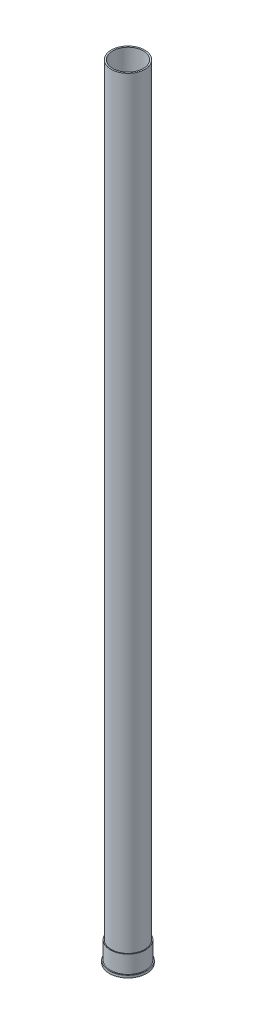
ISO-10303-21;
HEADER;
FILE_DESCRIPTION(('STEP AP214'),'2;1');
FILE_NAME('part.step','',(''),(''),'','','');
FILE_SCHEMA(('AUTOMOTIVE_DESIGN { 1 0 10303 214 1 1 1 1 }'));
ENDSEC;
DATA;
#1=APPLICATION_CONTEXT('core data for automotive mechanical design processes');
#2=APPLICATION_PROTOCOL_DEFINITION('international standard','automotive_design',2000,#1);
#3=PRODUCT_CONTEXT('',#1,'mechanical');
#4=PRODUCT('Part','Part','',(#3));
#5=PRODUCT_RELATED_PRODUCT_CATEGORY('part','',(#4));
#6=PRODUCT_DEFINITION_FORMATION('','',#4);
#7=PRODUCT_DEFINITION_CONTEXT('part definition',#1,'design');
#8=PRODUCT_DEFINITION('design','',#6,#7);
#9=PRODUCT_DEFINITION_SHAPE('','',#8);
#10=(LENGTH_UNIT() NAMED_UNIT(*) SI_UNIT(.MILLI.,.METRE.));
#11=(NAMED_UNIT(*) PLANE_ANGLE_UNIT() SI_UNIT($,.RADIAN.));
#12=(NAMED_UNIT(*) SI_UNIT($,.STERADIAN.) SOLID_ANGLE_UNIT());
#13=UNCERTAINTY_MEASURE_WITH_UNIT(LENGTH_MEASURE(1.E-05),#10,'distance_accuracy_value','');
#14=(GEOMETRIC_REPRESENTATION_CONTEXT(3) GLOBAL_UNCERTAINTY_ASSIGNED_CONTEXT((#13)) GLOBAL_UNIT_ASSIGNED_CONTEXT((#10,
#11,#12)) REPRESENTATION_CONTEXT('',''));
#15=CARTESIAN_POINT('',(0.,0.,0.));
#16=DIRECTION('',(0.,0.,1.));
#17=DIRECTION('',(1.,0.,0.));
#18=AXIS2_PLACEMENT_3D('',#15,#16,#17);
#19=CARTESIAN_POINT('',(0.,15.,0.));
#20=DIRECTION('',(0.,-1.,0.));
#21=DIRECTION('',(0.,0.,-1.));
#22=AXIS2_PLACEMENT_3D('',#19,#20,#21);
#23=CYLINDRICAL_SURFACE('',#22,13.462);
#24=CARTESIAN_POINT('',(0.,15.,0.));
#25=DIRECTION('',(0.,1.,0.));
#26=DIRECTION('',(0.,0.,1.));
#27=AXIS2_PLACEMENT_3D('',#24,#25,#26);
#28=CIRCLE('',#27,13.462);
#29=CARTESIAN_POINT('',(0.,15.,13.462));
#30=VERTEX_POINT('',#29);
#31=EDGE_CURVE('E51',#30,#30,#28,.T.);
#32=ORIENTED_EDGE('',*,*,#31,.T.);
#33=EDGE_LOOP('',(#32));
#34=FACE_BOUND('',#33,.T.);
#35=CARTESIAN_POINT('',(0.,-2.,0.));
#36=DIRECTION('',(0.,1.,0.));
#37=DIRECTION('',(0.,0.,1.));
#38=AXIS2_PLACEMENT_3D('',#35,#36,#37);
#39=CIRCLE('',#38,13.462);
#40=CARTESIAN_POINT('',(0.,-2.,13.462));
#41=VERTEX_POINT('',#40);
#42=EDGE_CURVE('E79',#41,#41,#39,.T.);
#43=ORIENTED_EDGE('',*,*,#42,.F.);
#44=EDGE_LOOP('',(#43));
#45=FACE_BOUND('',#44,.T.);
#46=ADVANCED_FACE('F43',(#34,#45),#23,.F.);
#47=CARTESIAN_POINT('',(0.,15.,0.));
#48=DIRECTION('',(0.,-1.,0.));
#49=DIRECTION('',(0.,0.,-1.));
#50=AXIS2_PLACEMENT_3D('',#47,#48,#49);
#51=CYLINDRICAL_SURFACE('',#50,15.);
#52=CARTESIAN_POINT('',(0.,15.,0.));
#53=DIRECTION('',(0.,1.,0.));
#54=DIRECTION('',(0.,0.,1.));
#55=AXIS2_PLACEMENT_3D('',#52,#53,#54);
#56=CIRCLE('',#55,15.);
#57=CARTESIAN_POINT('',(0.,15.,15.));
#58=VERTEX_POINT('',#57);
#59=EDGE_CURVE('E10',#58,#58,#56,.T.);
#60=ORIENTED_EDGE('',*,*,#59,.F.);
#61=EDGE_LOOP('',(#60));
#62=FACE_BOUND('',#61,.T.);
#63=CARTESIAN_POINT('',(0.,0.,0.));
#64=DIRECTION('',(0.,1.,0.));
#65=DIRECTION('',(0.,0.,1.));
#66=AXIS2_PLACEMENT_3D('',#63,#64,#65);
#67=CIRCLE('',#66,15.);
#68=CARTESIAN_POINT('',(0.,0.,15.));
#69=VERTEX_POINT('',#68);
#70=EDGE_CURVE('E46',#69,#69,#67,.T.);
#71=ORIENTED_EDGE('',*,*,#70,.T.);
#72=EDGE_LOOP('',(#71));
#73=FACE_BOUND('',#72,.T.);
#74=ADVANCED_FACE('F98',(#62,#73),#51,.T.);
#75=CARTESIAN_POINT('',(0.,15.,0.));
#76=DIRECTION('',(0.,1.,0.));
#77=DIRECTION('',(0.,0.,1.));
#78=AXIS2_PLACEMENT_3D('',#75,#76,#77);
#79=PLANE('',#78);
#80=CARTESIAN_POINT('',(0.,15.,0.));
#81=DIRECTION('',(0.,1.,0.));
#82=DIRECTION('',(0.,0.,1.));
#83=AXIS2_PLACEMENT_3D('',#80,#81,#82);
#84=CIRCLE('',#83,14.2875);
#85=CARTESIAN_POINT('',(0.,15.,14.2875));
#86=VERTEX_POINT('',#85);
#87=EDGE_CURVE('E59',#86,#86,#84,.T.);
#88=ORIENTED_EDGE('',*,*,#87,.F.);
#89=EDGE_LOOP('',(#88));
#90=FACE_BOUND('',#89,.T.);
#91=ORIENTED_EDGE('',*,*,#59,.T.);
#92=EDGE_LOOP('',(#91));
#93=FACE_BOUND('',#92,.T.);
#94=ADVANCED_FACE('F103',(#90,#93),#79,.T.);
#95=CARTESIAN_POINT('',(0.,15.,0.));
#96=DIRECTION('',(0.,1.,0.));
#97=DIRECTION('',(0.,0.,1.));
#98=AXIS2_PLACEMENT_3D('',#95,#96,#97);
#99=PLANE('',#98);
#100=CARTESIAN_POINT('',(0.,15.,0.));
#101=DIRECTION('',(0.,1.,0.));
#102=DIRECTION('',(0.,0.,1.));
#103=AXIS2_PLACEMENT_3D('',#100,#101,#102);
#104=CIRCLE('',#103,13.0429);
#105=CARTESIAN_POINT('',(0.,15.,13.0429));
#106=VERTEX_POINT('',#105);
#107=EDGE_CURVE('E64',#106,#106,#104,.T.);
#108=ORIENTED_EDGE('',*,*,#107,.T.);
#109=EDGE_LOOP('',(#108));
#110=FACE_BOUND('',#109,.T.);
#111=ORIENTED_EDGE('',*,*,#31,.F.);
#112=EDGE_LOOP('',(#111));
#113=FACE_BOUND('',#112,.T.);
#114=ADVANCED_FACE('F107',(#110,#113),#99,.F.);
#115=CARTESIAN_POINT('',(0.,665.,0.));
#116=DIRECTION('',(0.,-1.,0.));
#117=DIRECTION('',(0.,0.,-1.));
#118=AXIS2_PLACEMENT_3D('',#115,#116,#117);
#119=CYLINDRICAL_SURFACE('',#118,13.0429);
#120=CARTESIAN_POINT('',(0.,665.,0.));
#121=DIRECTION('',(0.,1.,0.));
#122=DIRECTION('',(0.,0.,1.));
#123=AXIS2_PLACEMENT_3D('',#120,#121,#122);
#124=CIRCLE('',#123,13.0429);
#125=CARTESIAN_POINT('',(0.,665.,13.0429));
#126=VERTEX_POINT('',#125);
#127=EDGE_CURVE('E63',#126,#126,#124,.T.);
#128=ORIENTED_EDGE('',*,*,#127,.T.);
#129=EDGE_LOOP('',(#128));
#130=FACE_BOUND('',#129,.T.);
#131=ORIENTED_EDGE('',*,*,#107,.F.);
#132=EDGE_LOOP('',(#131));
#133=FACE_BOUND('',#132,.T.);
#134=ADVANCED_FACE('F109',(#130,#133),#119,.F.);
#135=CARTESIAN_POINT('',(0.,665.,0.));
#136=DIRECTION('',(0.,-1.,0.));
#137=DIRECTION('',(0.,0.,-1.));
#138=AXIS2_PLACEMENT_3D('',#135,#136,#137);
#139=CYLINDRICAL_SURFACE('',#138,14.2875);
#140=CARTESIAN_POINT('',(0.,665.,0.));
#141=DIRECTION('',(0.,1.,0.));
#142=DIRECTION('',(0.,0.,1.));
#143=AXIS2_PLACEMENT_3D('',#140,#141,#142);
#144=CIRCLE('',#143,14.2875);
#145=CARTESIAN_POINT('',(0.,665.,14.2875));
#146=VERTEX_POINT('',#145);
#147=EDGE_CURVE('E56',#146,#146,#144,.T.);
#148=ORIENTED_EDGE('',*,*,#147,.F.);
#149=EDGE_LOOP('',(#148));
#150=FACE_BOUND('',#149,.T.);
#151=ORIENTED_EDGE('',*,*,#87,.T.);
#152=EDGE_LOOP('',(#151));
#153=FACE_BOUND('',#152,.T.);
#154=ADVANCED_FACE('F116',(#150,#153),#139,.T.);
#155=CARTESIAN_POINT('',(0.,665.,0.));
#156=DIRECTION('',(0.,1.,0.));
#157=DIRECTION('',(0.,0.,1.));
#158=AXIS2_PLACEMENT_3D('',#155,#156,#157);
#159=PLANE('',#158);
#160=ORIENTED_EDGE('',*,*,#127,.F.);
#161=EDGE_LOOP('',(#160));
#162=FACE_BOUND('',#161,.T.);
#163=ORIENTED_EDGE('',*,*,#147,.T.);
#164=EDGE_LOOP('',(#163));
#165=FACE_BOUND('',#164,.T.);
#166=ADVANCED_FACE('F123',(#162,#165),#159,.T.);
#167=CARTESIAN_POINT('',(0.,-2.,0.));
#168=DIRECTION('',(0.,1.,0.));
#169=DIRECTION('',(0.,0.,1.));
#170=AXIS2_PLACEMENT_3D('',#167,#168,#169);
#171=CYLINDRICAL_SURFACE('',#170,15.875);
#172=CARTESIAN_POINT('',(0.,-2.,0.));
#173=DIRECTION('',(0.,1.,0.));
#174=DIRECTION('',(0.,0.,1.));
#175=AXIS2_PLACEMENT_3D('',#172,#173,#174);
#176=CIRCLE('',#175,15.875);
#177=CARTESIAN_POINT('',(0.,-2.,15.875));
#178=VERTEX_POINT('',#177);
#179=EDGE_CURVE('E78',#178,#178,#176,.T.);
#180=ORIENTED_EDGE('',*,*,#179,.T.);
#181=EDGE_LOOP('',(#180));
#182=FACE_BOUND('',#181,.T.);
#183=CARTESIAN_POINT('',(0.,0.,0.));
#184=DIRECTION('',(0.,1.,0.));
#185=DIRECTION('',(0.,0.,1.));
#186=AXIS2_PLACEMENT_3D('',#183,#184,#185);
#187=CIRCLE('',#186,15.875);
#188=CARTESIAN_POINT('',(0.,0.,15.875));
#189=VERTEX_POINT('',#188);
#190=EDGE_CURVE('E74',#189,#189,#187,.T.);
#191=ORIENTED_EDGE('',*,*,#190,.F.);
#192=EDGE_LOOP('',(#191));
#193=FACE_BOUND('',#192,.T.);
#194=ADVANCED_FACE('F87',(#182,#193),#171,.T.);
#195=CARTESIAN_POINT('',(0.,-2.,0.));
#196=DIRECTION('',(0.,1.,0.));
#197=DIRECTION('',(0.,0.,1.));
#198=AXIS2_PLACEMENT_3D('',#195,#196,#197);
#199=PLANE('',#198);
#200=ORIENTED_EDGE('',*,*,#179,.F.);
#201=EDGE_LOOP('',(#200));
#202=FACE_BOUND('',#201,.T.);
#203=ORIENTED_EDGE('',*,*,#42,.T.);
#204=EDGE_LOOP('',(#203));
#205=FACE_BOUND('',#204,.T.);
#206=ADVANCED_FACE('F90',(#202,#205),#199,.F.);
#207=CARTESIAN_POINT('',(0.,0.,0.));
#208=DIRECTION('',(0.,1.,0.));
#209=DIRECTION('',(0.,0.,1.));
#210=AXIS2_PLACEMENT_3D('',#207,#208,#209);
#211=PLANE('',#210);
#212=ORIENTED_EDGE('',*,*,#70,.F.);
#213=EDGE_LOOP('',(#212));
#214=FACE_BOUND('',#213,.T.);
#215=ORIENTED_EDGE('',*,*,#190,.T.);
#216=EDGE_LOOP('',(#215));
#217=FACE_BOUND('',#216,.T.);
#218=ADVANCED_FACE('F93',(#214,#217),#211,.T.);
#219=CLOSED_SHELL('',(#46,#74,#94,#114,#134,#154,#166,#194,#206,#218));
#220=MANIFOLD_SOLID_BREP('B2',#219);
#221=ADVANCED_BREP_SHAPE_REPRESENTATION('',(#18,#220),#14);
#222=SHAPE_DEFINITION_REPRESENTATION(#9,#221);
ENDSEC;
END-ISO-10303-21;
